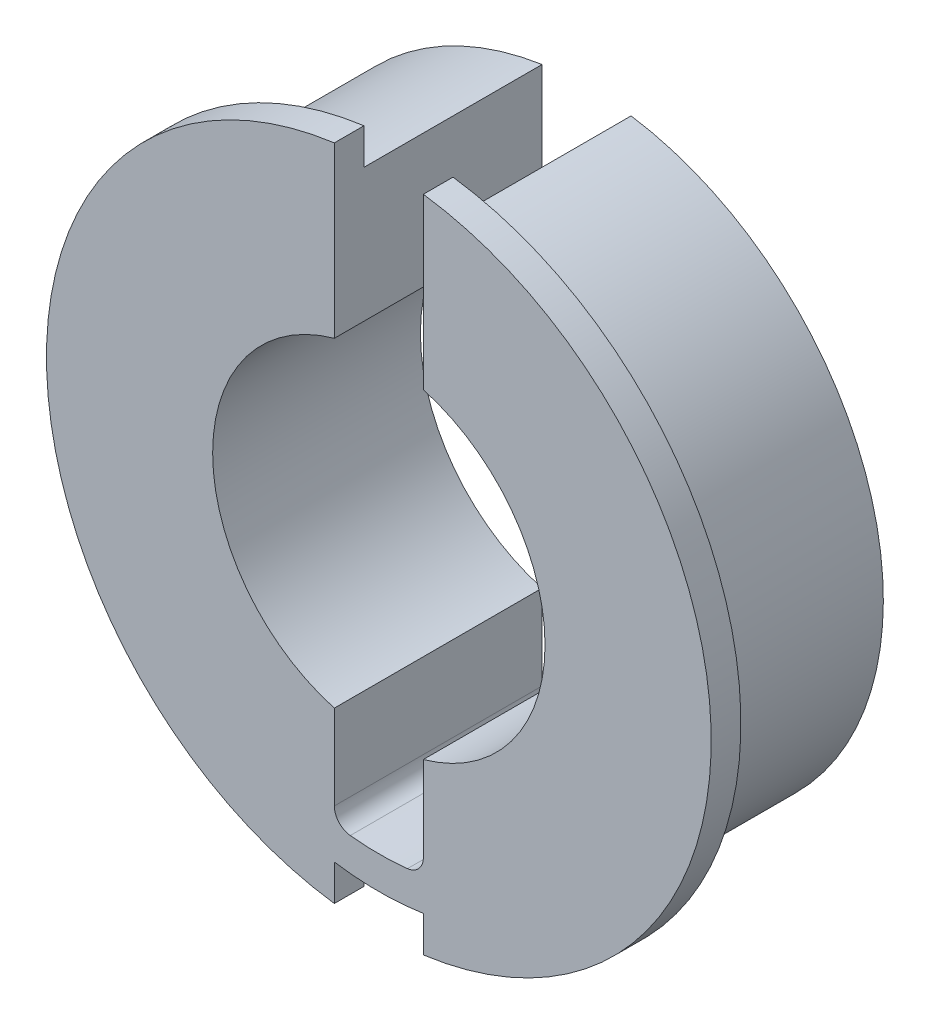
ISO-10303-21;
HEADER;
FILE_DESCRIPTION(('STEP AP214'),'2;1');
FILE_NAME('part.step','',(''),(''),'','','');
FILE_SCHEMA(('AUTOMOTIVE_DESIGN { 1 0 10303 214 1 1 1 1 }'));
ENDSEC;
DATA;
#1=APPLICATION_CONTEXT('core data for automotive mechanical design processes');
#2=APPLICATION_PROTOCOL_DEFINITION('international standard','automotive_design',2000,#1);
#3=PRODUCT_CONTEXT('',#1,'mechanical');
#4=PRODUCT('Part','Part','',(#3));
#5=PRODUCT_RELATED_PRODUCT_CATEGORY('part','',(#4));
#6=PRODUCT_DEFINITION_FORMATION('','',#4);
#7=PRODUCT_DEFINITION_CONTEXT('part definition',#1,'design');
#8=PRODUCT_DEFINITION('design','',#6,#7);
#9=PRODUCT_DEFINITION_SHAPE('','',#8);
#10=(LENGTH_UNIT() NAMED_UNIT(*) SI_UNIT(.MILLI.,.METRE.));
#11=(NAMED_UNIT(*) PLANE_ANGLE_UNIT() SI_UNIT($,.RADIAN.));
#12=(NAMED_UNIT(*) SI_UNIT($,.STERADIAN.) SOLID_ANGLE_UNIT());
#13=UNCERTAINTY_MEASURE_WITH_UNIT(LENGTH_MEASURE(1.E-05),#10,'distance_accuracy_value','');
#14=(GEOMETRIC_REPRESENTATION_CONTEXT(3) GLOBAL_UNCERTAINTY_ASSIGNED_CONTEXT((#13)) GLOBAL_UNIT_ASSIGNED_CONTEXT((#10,
#11,#12)) REPRESENTATION_CONTEXT('',''));
#15=CARTESIAN_POINT('',(0.,0.,0.));
#16=DIRECTION('',(0.,0.,1.));
#17=DIRECTION('',(1.,0.,0.));
#18=AXIS2_PLACEMENT_3D('',#15,#16,#17);
#19=CARTESIAN_POINT('',(0.,0.,7.62));
#20=DIRECTION('',(0.,0.,1.));
#21=DIRECTION('',(1.,0.,0.));
#22=AXIS2_PLACEMENT_3D('',#19,#20,#21);
#23=PLANE('',#22);
#24=CARTESIAN_POINT('',(0.,0.,7.62));
#25=DIRECTION('',(0.,0.,1.));
#26=DIRECTION('',(1.,0.,0.));
#27=AXIS2_PLACEMENT_3D('',#24,#25,#26);
#28=CIRCLE('',#27,14.224);
#29=CARTESIAN_POINT('',(1.905,-14.0958558094214,7.62));
#30=VERTEX_POINT('',#29);
#31=CARTESIAN_POINT('',(1.905,14.0958558094214,7.62));
#32=VERTEX_POINT('',#31);
#33=EDGE_CURVE('E227',#30,#32,#28,.T.);
#34=ORIENTED_EDGE('',*,*,#33,.F.);
#35=DIRECTION('',(0.,-1.,0.));
#36=VECTOR('',#35,1.);
#37=CARTESIAN_POINT('',(1.905,-14.224,7.62));
#38=LINE('',#37,#36);
#39=CARTESIAN_POINT('',(1.905,-12.5563121576361,7.62));
#40=VERTEX_POINT('',#39);
#41=EDGE_CURVE('E171',#40,#30,#38,.T.);
#42=ORIENTED_EDGE('',*,*,#41,.F.);
#43=CARTESIAN_POINT('',(0.,0.,7.62));
#44=DIRECTION('',(0.,0.,1.));
#45=DIRECTION('',(1.,0.,0.));
#46=AXIS2_PLACEMENT_3D('',#43,#44,#45);
#47=CIRCLE('',#46,12.7);
#48=CARTESIAN_POINT('',(1.905,12.5563121576361,7.62));
#49=VERTEX_POINT('',#48);
#50=EDGE_CURVE('E234',#40,#49,#47,.T.);
#51=ORIENTED_EDGE('',*,*,#50,.T.);
#52=DIRECTION('',(0.,1.,0.));
#53=VECTOR('',#52,1.);
#54=CARTESIAN_POINT('',(1.905,0.,7.62));
#55=LINE('',#54,#53);
#56=EDGE_CURVE('E188',#49,#32,#55,.T.);
#57=ORIENTED_EDGE('',*,*,#56,.T.);
#58=EDGE_LOOP('',(#34,#42,#51,#57));
#59=FACE_BOUND('',#58,.T.);
#60=ADVANCED_FACE('F33',(#59),#23,.F.);
#61=CARTESIAN_POINT('',(0.,0.,8.89));
#62=DIRECTION('',(0.,0.,-1.));
#63=DIRECTION('',(-1.,0.,0.));
#64=AXIS2_PLACEMENT_3D('',#61,#62,#63);
#65=CYLINDRICAL_SURFACE('',#64,14.224);
#66=CARTESIAN_POINT('',(0.,0.,8.89));
#67=DIRECTION('',(0.,0.,1.));
#68=DIRECTION('',(1.,0.,0.));
#69=AXIS2_PLACEMENT_3D('',#66,#67,#68);
#70=CIRCLE('',#69,14.224);
#71=CARTESIAN_POINT('',(1.905,-14.0958558094214,8.89));
#72=VERTEX_POINT('',#71);
#73=CARTESIAN_POINT('',(1.905,14.0958558094214,8.89));
#74=VERTEX_POINT('',#73);
#75=EDGE_CURVE('E223',#72,#74,#70,.T.);
#76=ORIENTED_EDGE('',*,*,#75,.F.);
#77=DIRECTION('',(0.,0.,-1.));
#78=VECTOR('',#77,1.);
#79=CARTESIAN_POINT('',(1.905,-14.0958558094214,8.89));
#80=LINE('',#79,#78);
#81=EDGE_CURVE('E245',#72,#30,#80,.T.);
#82=ORIENTED_EDGE('',*,*,#81,.T.);
#83=ORIENTED_EDGE('',*,*,#33,.T.);
#84=DIRECTION('',(0.,0.,-1.));
#85=VECTOR('',#84,1.);
#86=CARTESIAN_POINT('',(1.905,14.0958558094214,8.89));
#87=LINE('',#86,#85);
#88=EDGE_CURVE('E233',#32,#74,#87,.F.);
#89=ORIENTED_EDGE('',*,*,#88,.T.);
#90=EDGE_LOOP('',(#76,#82,#83,#89));
#91=FACE_BOUND('',#90,.T.);
#92=ADVANCED_FACE('F305',(#91),#65,.T.);
#93=CARTESIAN_POINT('',(0.,0.,7.62));
#94=DIRECTION('',(0.,0.,-1.));
#95=DIRECTION('',(-1.,0.,0.));
#96=AXIS2_PLACEMENT_3D('',#93,#94,#95);
#97=CYLINDRICAL_SURFACE('',#96,7.112);
#98=DIRECTION('',(0.,0.,-1.));
#99=VECTOR('',#98,1.);
#100=CARTESIAN_POINT('',(-1.905,6.85211784778983,7.62));
#101=LINE('',#100,#99);
#102=CARTESIAN_POINT('',(-1.905,6.85211784778984,8.89));
#103=VERTEX_POINT('',#102);
#104=CARTESIAN_POINT('',(-1.905,6.85211784778983,0.));
#105=VERTEX_POINT('',#104);
#106=EDGE_CURVE('E215',#103,#105,#101,.T.);
#107=ORIENTED_EDGE('',*,*,#106,.F.);
#108=CARTESIAN_POINT('',(0.,0.,8.89));
#109=DIRECTION('',(0.,0.,1.));
#110=DIRECTION('',(1.,0.,0.));
#111=AXIS2_PLACEMENT_3D('',#108,#109,#110);
#112=CIRCLE('',#111,7.112);
#113=CARTESIAN_POINT('',(-1.905,-6.85211784778983,8.89));
#114=VERTEX_POINT('',#113);
#115=EDGE_CURVE('E220',#103,#114,#112,.T.);
#116=ORIENTED_EDGE('',*,*,#115,.T.);
#117=DIRECTION('',(0.,0.,-1.));
#118=VECTOR('',#117,1.);
#119=CARTESIAN_POINT('',(-1.905,-6.85211784778983,7.62));
#120=LINE('',#119,#118);
#121=CARTESIAN_POINT('',(-1.905,-6.85211784778983,0.));
#122=VERTEX_POINT('',#121);
#123=EDGE_CURVE('E212',#122,#114,#120,.F.);
#124=ORIENTED_EDGE('',*,*,#123,.F.);
#125=CARTESIAN_POINT('',(0.,0.,0.));
#126=DIRECTION('',(0.,0.,1.));
#127=DIRECTION('',(1.,0.,0.));
#128=AXIS2_PLACEMENT_3D('',#125,#126,#127);
#129=CIRCLE('',#128,7.112);
#130=EDGE_CURVE('E230',#105,#122,#129,.T.);
#131=ORIENTED_EDGE('',*,*,#130,.F.);
#132=EDGE_LOOP('',(#107,#116,#124,#131));
#133=FACE_BOUND('',#132,.T.);
#134=ADVANCED_FACE('F326',(#133),#97,.F.);
#135=CARTESIAN_POINT('',(0.,0.,0.));
#136=DIRECTION('',(0.,0.,1.));
#137=DIRECTION('',(1.,0.,0.));
#138=AXIS2_PLACEMENT_3D('',#135,#136,#137);
#139=PLANE('',#138);
#140=CARTESIAN_POINT('',(0.,0.,0.));
#141=DIRECTION('',(0.,0.,1.));
#142=DIRECTION('',(1.,0.,0.));
#143=AXIS2_PLACEMENT_3D('',#140,#141,#142);
#144=CIRCLE('',#143,12.7);
#145=CARTESIAN_POINT('',(-1.905,12.5563121576361,0.));
#146=VERTEX_POINT('',#145);
#147=CARTESIAN_POINT('',(1.905,12.5563121576361,0.));
#148=VERTEX_POINT('',#147);
#149=EDGE_CURVE('E235',#146,#148,#144,.T.);
#150=ORIENTED_EDGE('',*,*,#149,.F.);
#151=DIRECTION('',(0.,1.,0.));
#152=VECTOR('',#151,1.);
#153=CARTESIAN_POINT('',(-1.905,14.224,0.));
#154=LINE('',#153,#152);
#155=EDGE_CURVE('E177',#105,#146,#154,.T.);
#156=ORIENTED_EDGE('',*,*,#155,.F.);
#157=ORIENTED_EDGE('',*,*,#130,.T.);
#158=CARTESIAN_POINT('',(-1.905,-10.478846883126,0.));
#159=VERTEX_POINT('',#158);
#160=EDGE_CURVE('E189',#159,#122,#154,.T.);
#161=ORIENTED_EDGE('',*,*,#160,.F.);
#162=CARTESIAN_POINT('',(-1.143,-10.478846883126,0.));
#163=DIRECTION('',(0.,0.,1.));
#164=DIRECTION('',(1.,0.,0.));
#165=AXIS2_PLACEMENT_3D('',#162,#163,#164);
#166=CIRCLE('',#165,0.762);
#167=CARTESIAN_POINT('',(-1.2256265060241,-11.2363538867255,0.));
#168=VERTEX_POINT('',#167);
#169=EDGE_CURVE('E257',#159,#168,#166,.T.);
#170=ORIENTED_EDGE('',*,*,#169,.T.);
#171=CARTESIAN_POINT('',(0.,1.64798730217797E-13,0.));
#172=DIRECTION('',(0.,0.,-1.));
#173=DIRECTION('',(-1.,0.,0.));
#174=AXIS2_PLACEMENT_3D('',#171,#172,#173);
#175=CIRCLE('',#174,11.3030000000002);
#176=CARTESIAN_POINT('',(1.2256265060241,-11.2363538867255,0.));
#177=VERTEX_POINT('',#176);
#178=EDGE_CURVE('E194',#177,#168,#175,.T.);
#179=ORIENTED_EDGE('',*,*,#178,.F.);
#180=CARTESIAN_POINT('',(1.143,-10.478846883126,0.));
#181=DIRECTION('',(0.,0.,1.));
#182=DIRECTION('',(1.,0.,0.));
#183=AXIS2_PLACEMENT_3D('',#180,#181,#182);
#184=CIRCLE('',#183,0.762);
#185=CARTESIAN_POINT('',(1.905,-10.478846883126,0.));
#186=VERTEX_POINT('',#185);
#187=EDGE_CURVE('E41',#177,#186,#184,.T.);
#188=ORIENTED_EDGE('',*,*,#187,.T.);
#189=DIRECTION('',(0.,-1.,0.));
#190=VECTOR('',#189,1.);
#191=CARTESIAN_POINT('',(1.905,14.224,0.));
#192=LINE('',#191,#190);
#193=CARTESIAN_POINT('',(1.905,-6.85211784778983,0.));
#194=VERTEX_POINT('',#193);
#195=EDGE_CURVE('E191',#194,#186,#192,.T.);
#196=ORIENTED_EDGE('',*,*,#195,.F.);
#197=CARTESIAN_POINT('',(1.905,6.85211784778983,0.));
#198=VERTEX_POINT('',#197);
#199=EDGE_CURVE('E222',#194,#198,#129,.T.);
#200=ORIENTED_EDGE('',*,*,#199,.T.);
#201=EDGE_CURVE('E193',#148,#198,#192,.T.);
#202=ORIENTED_EDGE('',*,*,#201,.F.);
#203=EDGE_LOOP('',(#150,#156,#157,#161,#170,#179,#188,#196,#200,#202));
#204=FACE_BOUND('',#203,.T.);
#205=ADVANCED_FACE('F274',(#204),#139,.F.);
#206=CARTESIAN_POINT('',(0.,0.,7.62));
#207=DIRECTION('',(0.,0.,-1.));
#208=DIRECTION('',(-1.,0.,0.));
#209=AXIS2_PLACEMENT_3D('',#206,#207,#208);
#210=CYLINDRICAL_SURFACE('',#209,12.7);
#211=CARTESIAN_POINT('',(-1.905,12.5563121576361,7.62));
#212=VERTEX_POINT('',#211);
#213=CARTESIAN_POINT('',(-1.905,-12.5563121576361,7.62));
#214=VERTEX_POINT('',#213);
#215=EDGE_CURVE('E231',#212,#214,#47,.T.);
#216=ORIENTED_EDGE('',*,*,#215,.F.);
#217=DIRECTION('',(0.,0.,-1.));
#218=VECTOR('',#217,1.);
#219=CARTESIAN_POINT('',(-1.905,12.5563121576361,7.62));
#220=LINE('',#219,#218);
#221=EDGE_CURVE('E209',#212,#146,#220,.T.);
#222=ORIENTED_EDGE('',*,*,#221,.T.);
#223=ORIENTED_EDGE('',*,*,#149,.T.);
#224=DIRECTION('',(0.,0.,-1.));
#225=VECTOR('',#224,1.);
#226=CARTESIAN_POINT('',(1.905,12.5563121576361,7.62));
#227=LINE('',#226,#225);
#228=EDGE_CURVE('E199',#148,#49,#227,.F.);
#229=ORIENTED_EDGE('',*,*,#228,.T.);
#230=ORIENTED_EDGE('',*,*,#50,.F.);
#231=DIRECTION('',(0.,0.,-1.));
#232=VECTOR('',#231,1.);
#233=CARTESIAN_POINT('',(1.905,-12.5563121576361,8.89));
#234=LINE('',#233,#232);
#235=CARTESIAN_POINT('',(1.905,-12.5563121576361,8.89));
#236=VERTEX_POINT('',#235);
#237=EDGE_CURVE('E155',#236,#40,#234,.T.);
#238=ORIENTED_EDGE('',*,*,#237,.F.);
#239=CARTESIAN_POINT('',(0.,0.,8.89));
#240=DIRECTION('',(0.,0.,1.));
#241=DIRECTION('',(-1.,0.,0.));
#242=AXIS2_PLACEMENT_3D('',#239,#240,#241);
#243=CIRCLE('',#242,12.7);
#244=CARTESIAN_POINT('',(-1.905,-12.5563121576361,8.89));
#245=VERTEX_POINT('',#244);
#246=EDGE_CURVE('E159',#245,#236,#243,.T.);
#247=ORIENTED_EDGE('',*,*,#246,.F.);
#248=DIRECTION('',(0.,0.,-1.));
#249=VECTOR('',#248,1.);
#250=CARTESIAN_POINT('',(-1.905,-12.5563121576361,8.89));
#251=LINE('',#250,#249);
#252=EDGE_CURVE('E144',#245,#214,#251,.T.);
#253=ORIENTED_EDGE('',*,*,#252,.T.);
#254=EDGE_LOOP('',(#216,#222,#223,#229,#230,#238,#247,#253));
#255=FACE_BOUND('',#254,.T.);
#256=ADVANCED_FACE('F160',(#255),#210,.T.);
#257=DIRECTION('',(0.,0.,-1.));
#258=VECTOR('',#257,1.);
#259=CARTESIAN_POINT('',(1.905,-6.85211784778983,7.62));
#260=LINE('',#259,#258);
#261=CARTESIAN_POINT('',(1.905,-6.85211784778983,8.89));
#262=VERTEX_POINT('',#261);
#263=EDGE_CURVE('E204',#262,#194,#260,.T.);
#264=ORIENTED_EDGE('',*,*,#263,.F.);
#265=CARTESIAN_POINT('',(1.905,6.85211784778984,8.89));
#266=VERTEX_POINT('',#265);
#267=EDGE_CURVE('E217',#262,#266,#112,.T.);
#268=ORIENTED_EDGE('',*,*,#267,.T.);
#269=DIRECTION('',(0.,0.,-1.));
#270=VECTOR('',#269,1.);
#271=CARTESIAN_POINT('',(1.905,6.85211784778983,7.62));
#272=LINE('',#271,#270);
#273=EDGE_CURVE('E202',#198,#266,#272,.F.);
#274=ORIENTED_EDGE('',*,*,#273,.F.);
#275=ORIENTED_EDGE('',*,*,#199,.F.);
#276=EDGE_LOOP('',(#264,#268,#274,#275));
#277=FACE_BOUND('',#276,.T.);
#278=ADVANCED_FACE('F287',(#277),#97,.F.);
#279=ORIENTED_EDGE('',*,*,#215,.T.);
#280=DIRECTION('',(0.,1.,0.));
#281=VECTOR('',#280,1.);
#282=CARTESIAN_POINT('',(-1.905,-12.5563121576361,7.62));
#283=LINE('',#282,#281);
#284=CARTESIAN_POINT('',(-1.905,-14.0958558094214,7.62));
#285=VERTEX_POINT('',#284);
#286=EDGE_CURVE('E151',#285,#214,#283,.T.);
#287=ORIENTED_EDGE('',*,*,#286,.F.);
#288=CARTESIAN_POINT('',(-1.905,14.0958558094214,7.62));
#289=VERTEX_POINT('',#288);
#290=EDGE_CURVE('E224',#289,#285,#28,.T.);
#291=ORIENTED_EDGE('',*,*,#290,.F.);
#292=DIRECTION('',(0.,-1.,0.));
#293=VECTOR('',#292,1.);
#294=CARTESIAN_POINT('',(-1.905,0.,7.62));
#295=LINE('',#294,#293);
#296=EDGE_CURVE('E206',#289,#212,#295,.T.);
#297=ORIENTED_EDGE('',*,*,#296,.T.);
#298=EDGE_LOOP('',(#279,#287,#291,#297));
#299=FACE_BOUND('',#298,.T.);
#300=ADVANCED_FACE('F296',(#299),#23,.F.);
#301=CARTESIAN_POINT('',(0.,0.,8.89));
#302=DIRECTION('',(0.,0.,1.));
#303=DIRECTION('',(1.,0.,0.));
#304=AXIS2_PLACEMENT_3D('',#301,#302,#303);
#305=PLANE('',#304);
#306=DIRECTION('',(0.,-1.,0.));
#307=VECTOR('',#306,1.);
#308=CARTESIAN_POINT('',(1.905,-14.224,8.89));
#309=LINE('',#308,#307);
#310=EDGE_CURVE('E156',#236,#72,#309,.T.);
#311=ORIENTED_EDGE('',*,*,#310,.T.);
#312=ORIENTED_EDGE('',*,*,#75,.T.);
#313=DIRECTION('',(0.,-1.,0.));
#314=VECTOR('',#313,1.);
#315=CARTESIAN_POINT('',(1.905,14.224,8.89));
#316=LINE('',#315,#314);
#317=EDGE_CURVE('E184',#74,#266,#316,.T.);
#318=ORIENTED_EDGE('',*,*,#317,.T.);
#319=ORIENTED_EDGE('',*,*,#267,.F.);
#320=CARTESIAN_POINT('',(1.905,-10.478846883126,8.89));
#321=VERTEX_POINT('',#320);
#322=EDGE_CURVE('E181',#262,#321,#316,.T.);
#323=ORIENTED_EDGE('',*,*,#322,.T.);
#324=CARTESIAN_POINT('',(1.143,-10.478846883126,8.89));
#325=DIRECTION('',(0.,0.,1.));
#326=DIRECTION('',(1.,0.,0.));
#327=AXIS2_PLACEMENT_3D('',#324,#325,#326);
#328=CIRCLE('',#327,0.762);
#329=CARTESIAN_POINT('',(1.2256265060241,-11.2363538867255,8.89));
#330=VERTEX_POINT('',#329);
#331=EDGE_CURVE('E11',#321,#330,#328,.F.);
#332=ORIENTED_EDGE('',*,*,#331,.T.);
#333=CARTESIAN_POINT('',(0.,1.64798730217797E-13,8.89));
#334=DIRECTION('',(0.,0.,-1.));
#335=DIRECTION('',(-1.,0.,0.));
#336=AXIS2_PLACEMENT_3D('',#333,#334,#335);
#337=CIRCLE('',#336,11.3030000000002);
#338=CARTESIAN_POINT('',(-1.2256265060241,-11.2363538867255,8.89));
#339=VERTEX_POINT('',#338);
#340=EDGE_CURVE('E185',#330,#339,#337,.T.);
#341=ORIENTED_EDGE('',*,*,#340,.T.);
#342=CARTESIAN_POINT('',(-1.143,-10.478846883126,8.89));
#343=DIRECTION('',(0.,0.,1.));
#344=DIRECTION('',(1.,0.,0.));
#345=AXIS2_PLACEMENT_3D('',#342,#343,#344);
#346=CIRCLE('',#345,0.762);
#347=CARTESIAN_POINT('',(-1.905,-10.478846883126,8.89));
#348=VERTEX_POINT('',#347);
#349=EDGE_CURVE('E259',#339,#348,#346,.F.);
#350=ORIENTED_EDGE('',*,*,#349,.T.);
#351=DIRECTION('',(0.,1.,0.));
#352=VECTOR('',#351,1.);
#353=CARTESIAN_POINT('',(-1.905,14.224,8.89));
#354=LINE('',#353,#352);
#355=EDGE_CURVE('E179',#348,#114,#354,.T.);
#356=ORIENTED_EDGE('',*,*,#355,.T.);
#357=ORIENTED_EDGE('',*,*,#115,.F.);
#358=CARTESIAN_POINT('',(-1.905,14.0958558094214,8.89));
#359=VERTEX_POINT('',#358);
#360=EDGE_CURVE('E182',#103,#359,#354,.T.);
#361=ORIENTED_EDGE('',*,*,#360,.T.);
#362=CARTESIAN_POINT('',(-1.905,-14.0958558094214,8.89));
#363=VERTEX_POINT('',#362);
#364=EDGE_CURVE('E170',#359,#363,#70,.T.);
#365=ORIENTED_EDGE('',*,*,#364,.T.);
#366=DIRECTION('',(0.,1.,0.));
#367=VECTOR('',#366,1.);
#368=CARTESIAN_POINT('',(-1.905,-12.5563121576361,8.89));
#369=LINE('',#368,#367);
#370=EDGE_CURVE('E148',#363,#245,#369,.T.);
#371=ORIENTED_EDGE('',*,*,#370,.T.);
#372=ORIENTED_EDGE('',*,*,#246,.T.);
#373=EDGE_LOOP('',(#311,#312,#318,#319,#323,#332,#341,#350,#356,#357,#361,#365,#371,#372));
#374=FACE_BOUND('',#373,.T.);
#375=ADVANCED_FACE('F167',(#374),#305,.T.);
#376=ORIENTED_EDGE('',*,*,#290,.T.);
#377=DIRECTION('',(0.,0.,-1.));
#378=VECTOR('',#377,1.);
#379=CARTESIAN_POINT('',(-1.905,-14.0958558094214,8.89));
#380=LINE('',#379,#378);
#381=EDGE_CURVE('E243',#285,#363,#380,.F.);
#382=ORIENTED_EDGE('',*,*,#381,.T.);
#383=ORIENTED_EDGE('',*,*,#364,.F.);
#384=DIRECTION('',(0.,0.,-1.));
#385=VECTOR('',#384,1.);
#386=CARTESIAN_POINT('',(-1.905,14.0958558094214,8.89));
#387=LINE('',#386,#385);
#388=EDGE_CURVE('E240',#359,#289,#387,.T.);
#389=ORIENTED_EDGE('',*,*,#388,.T.);
#390=EDGE_LOOP('',(#376,#382,#383,#389));
#391=FACE_BOUND('',#390,.T.);
#392=ADVANCED_FACE('F298',(#391),#65,.T.);
#393=CARTESIAN_POINT('',(1.905,14.224,8.89));
#394=DIRECTION('',(1.,0.,0.));
#395=DIRECTION('',(0.,1.,0.));
#396=AXIS2_PLACEMENT_3D('',#393,#394,#395);
#397=PLANE('',#396);
#398=ORIENTED_EDGE('',*,*,#273,.T.);
#399=ORIENTED_EDGE('',*,*,#317,.F.);
#400=ORIENTED_EDGE('',*,*,#88,.F.);
#401=ORIENTED_EDGE('',*,*,#56,.F.);
#402=ORIENTED_EDGE('',*,*,#228,.F.);
#403=ORIENTED_EDGE('',*,*,#201,.T.);
#404=EDGE_LOOP('',(#398,#399,#400,#401,#402,#403));
#405=FACE_BOUND('',#404,.T.);
#406=ADVANCED_FACE('F310',(#405),#397,.F.);
#407=CARTESIAN_POINT('',(-1.905,14.224,8.89));
#408=DIRECTION('',(-1.,0.,0.));
#409=DIRECTION('',(0.,-1.,0.));
#410=AXIS2_PLACEMENT_3D('',#407,#408,#409);
#411=PLANE('',#410);
#412=ORIENTED_EDGE('',*,*,#106,.T.);
#413=ORIENTED_EDGE('',*,*,#155,.T.);
#414=ORIENTED_EDGE('',*,*,#221,.F.);
#415=ORIENTED_EDGE('',*,*,#296,.F.);
#416=ORIENTED_EDGE('',*,*,#388,.F.);
#417=ORIENTED_EDGE('',*,*,#360,.F.);
#418=EDGE_LOOP('',(#412,#413,#414,#415,#416,#417));
#419=FACE_BOUND('',#418,.T.);
#420=ADVANCED_FACE('F293',(#419),#411,.F.);
#421=ORIENTED_EDGE('',*,*,#355,.F.);
#422=DIRECTION('',(0.,0.,1.));
#423=VECTOR('',#422,1.);
#424=CARTESIAN_POINT('',(-1.905,-10.478846883126,0.));
#425=LINE('',#424,#423);
#426=EDGE_CURVE('E248',#348,#159,#425,.F.);
#427=ORIENTED_EDGE('',*,*,#426,.T.);
#428=ORIENTED_EDGE('',*,*,#160,.T.);
#429=ORIENTED_EDGE('',*,*,#123,.T.);
#430=EDGE_LOOP('',(#421,#427,#428,#429));
#431=FACE_BOUND('',#430,.T.);
#432=ADVANCED_FACE('F268',(#431),#411,.F.);
#433=ORIENTED_EDGE('',*,*,#195,.T.);
#434=DIRECTION('',(0.,0.,1.));
#435=VECTOR('',#434,1.);
#436=CARTESIAN_POINT('',(1.905,-10.478846883126,8.89));
#437=LINE('',#436,#435);
#438=EDGE_CURVE('E48',#186,#321,#437,.T.);
#439=ORIENTED_EDGE('',*,*,#438,.T.);
#440=ORIENTED_EDGE('',*,*,#322,.F.);
#441=ORIENTED_EDGE('',*,*,#263,.T.);
#442=EDGE_LOOP('',(#433,#439,#440,#441));
#443=FACE_BOUND('',#442,.T.);
#444=ADVANCED_FACE('F284',(#443),#397,.F.);
#445=CARTESIAN_POINT('',(0.,1.64798730217797E-13,8.89));
#446=DIRECTION('',(0.,0.,-1.));
#447=DIRECTION('',(-1.,0.,0.));
#448=AXIS2_PLACEMENT_3D('',#445,#446,#447);
#449=CYLINDRICAL_SURFACE('',#448,11.3030000000002);
#450=ORIENTED_EDGE('',*,*,#178,.T.);
#451=DIRECTION('',(0.,0.,-1.));
#452=VECTOR('',#451,1.);
#453=CARTESIAN_POINT('',(-1.2256265060241,-11.2363538867255,8.89));
#454=LINE('',#453,#452);
#455=EDGE_CURVE('E254',#168,#339,#454,.F.);
#456=ORIENTED_EDGE('',*,*,#455,.T.);
#457=ORIENTED_EDGE('',*,*,#340,.F.);
#458=DIRECTION('',(0.,0.,-1.));
#459=VECTOR('',#458,1.);
#460=CARTESIAN_POINT('',(1.2256265060241,-11.2363538867255,8.89));
#461=LINE('',#460,#459);
#462=EDGE_CURVE('E251',#330,#177,#461,.T.);
#463=ORIENTED_EDGE('',*,*,#462,.T.);
#464=EDGE_LOOP('',(#450,#456,#457,#463));
#465=FACE_BOUND('',#464,.T.);
#466=ADVANCED_FACE('F277',(#465),#449,.F.);
#467=CARTESIAN_POINT('',(1.905,-14.224,8.89));
#468=DIRECTION('',(1.,0.,0.));
#469=DIRECTION('',(0.,1.,0.));
#470=AXIS2_PLACEMENT_3D('',#467,#468,#469);
#471=PLANE('',#470);
#472=ORIENTED_EDGE('',*,*,#310,.F.);
#473=ORIENTED_EDGE('',*,*,#237,.T.);
#474=ORIENTED_EDGE('',*,*,#41,.T.);
#475=ORIENTED_EDGE('',*,*,#81,.F.);
#476=EDGE_LOOP('',(#472,#473,#474,#475));
#477=FACE_BOUND('',#476,.T.);
#478=ADVANCED_FACE('F312',(#477),#471,.F.);
#479=CARTESIAN_POINT('',(-1.905,-12.5563121576361,8.89));
#480=DIRECTION('',(-1.,0.,0.));
#481=DIRECTION('',(0.,-1.,0.));
#482=AXIS2_PLACEMENT_3D('',#479,#480,#481);
#483=PLANE('',#482);
#484=ORIENTED_EDGE('',*,*,#286,.T.);
#485=ORIENTED_EDGE('',*,*,#252,.F.);
#486=ORIENTED_EDGE('',*,*,#370,.F.);
#487=ORIENTED_EDGE('',*,*,#381,.F.);
#488=EDGE_LOOP('',(#484,#485,#486,#487));
#489=FACE_BOUND('',#488,.T.);
#490=ADVANCED_FACE('F146',(#489),#483,.F.);
#491=CARTESIAN_POINT('',(-1.143,-10.478846883126,8.89));
#492=DIRECTION('',(0.,0.,-1.));
#493=DIRECTION('',(-1.,0.,0.));
#494=AXIS2_PLACEMENT_3D('',#491,#492,#493);
#495=CYLINDRICAL_SURFACE('',#494,0.762);
#496=ORIENTED_EDGE('',*,*,#349,.F.);
#497=ORIENTED_EDGE('',*,*,#455,.F.);
#498=ORIENTED_EDGE('',*,*,#169,.F.);
#499=ORIENTED_EDGE('',*,*,#426,.F.);
#500=EDGE_LOOP('',(#496,#497,#498,#499));
#501=FACE_BOUND('',#500,.T.);
#502=ADVANCED_FACE('F272',(#501),#495,.F.);
#503=CARTESIAN_POINT('',(1.143,-10.478846883126,8.89));
#504=DIRECTION('',(0.,0.,-1.));
#505=DIRECTION('',(-1.,0.,0.));
#506=AXIS2_PLACEMENT_3D('',#503,#504,#505);
#507=CYLINDRICAL_SURFACE('',#506,0.762);
#508=ORIENTED_EDGE('',*,*,#331,.F.);
#509=ORIENTED_EDGE('',*,*,#438,.F.);
#510=ORIENTED_EDGE('',*,*,#187,.F.);
#511=ORIENTED_EDGE('',*,*,#462,.F.);
#512=EDGE_LOOP('',(#508,#509,#510,#511));
#513=FACE_BOUND('',#512,.T.);
#514=ADVANCED_FACE('F35',(#513),#507,.F.);
#515=CLOSED_SHELL('',(#60,#92,#134,#205,#256,#278,#300,#375,#392,#406,#420,#432,#444,#466,#478,
#490,#502,#514));
#516=MANIFOLD_SOLID_BREP('B2',#515);
#517=ADVANCED_BREP_SHAPE_REPRESENTATION('',(#18,#516),#14);
#518=SHAPE_DEFINITION_REPRESENTATION(#9,#517);
ENDSEC;
END-ISO-10303-21;
